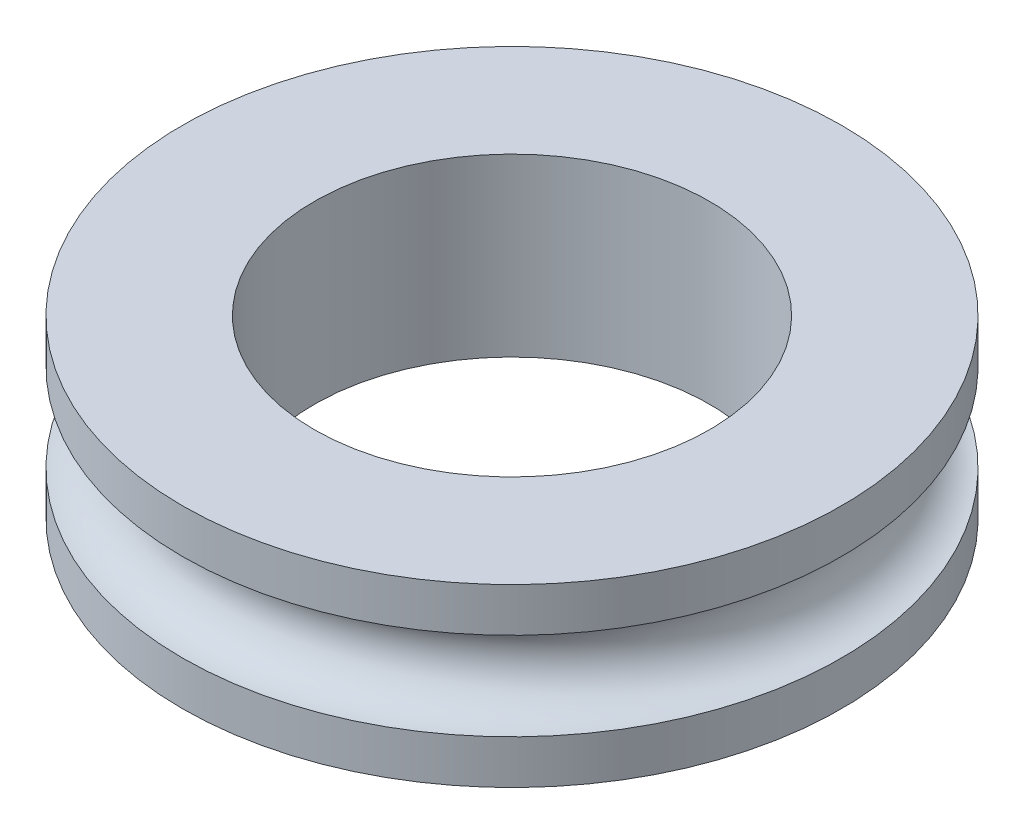
ISO-10303-21;
HEADER;
FILE_DESCRIPTION(('STEP AP214'),'2;1');
FILE_NAME('part.step','',(''),(''),'','','');
FILE_SCHEMA(('AUTOMOTIVE_DESIGN { 1 0 10303 214 1 1 1 1 }'));
ENDSEC;
DATA;
#1=APPLICATION_CONTEXT('core data for automotive mechanical design processes');
#2=APPLICATION_PROTOCOL_DEFINITION('international standard','automotive_design',2000,#1);
#3=PRODUCT_CONTEXT('',#1,'mechanical');
#4=PRODUCT('Part','Part','',(#3));
#5=PRODUCT_RELATED_PRODUCT_CATEGORY('part','',(#4));
#6=PRODUCT_DEFINITION_FORMATION('','',#4);
#7=PRODUCT_DEFINITION_CONTEXT('part definition',#1,'design');
#8=PRODUCT_DEFINITION('design','',#6,#7);
#9=PRODUCT_DEFINITION_SHAPE('','',#8);
#10=(LENGTH_UNIT() NAMED_UNIT(*) SI_UNIT(.MILLI.,.METRE.));
#11=(NAMED_UNIT(*) PLANE_ANGLE_UNIT() SI_UNIT($,.RADIAN.));
#12=(NAMED_UNIT(*) SI_UNIT($,.STERADIAN.) SOLID_ANGLE_UNIT());
#13=UNCERTAINTY_MEASURE_WITH_UNIT(LENGTH_MEASURE(1.E-05),#10,'distance_accuracy_value','');
#14=(GEOMETRIC_REPRESENTATION_CONTEXT(3) GLOBAL_UNCERTAINTY_ASSIGNED_CONTEXT((#13)) GLOBAL_UNIT_ASSIGNED_CONTEXT((#10,
#11,#12)) REPRESENTATION_CONTEXT('',''));
#15=CARTESIAN_POINT('',(0.,0.,0.));
#16=DIRECTION('',(0.,0.,1.));
#17=DIRECTION('',(1.,0.,0.));
#18=AXIS2_PLACEMENT_3D('',#15,#16,#17);
#19=CARTESIAN_POINT('',(0.,4.,0.));
#20=DIRECTION('',(0.,-1.,0.));
#21=DIRECTION('',(0.,0.,-1.));
#22=AXIS2_PLACEMENT_3D('',#19,#20,#21);
#23=CYLINDRICAL_SURFACE('',#22,7.5);
#24=CARTESIAN_POINT('',(0.,0.,0.));
#25=DIRECTION('',(0.,1.,0.));
#26=DIRECTION('',(0.,0.,1.));
#27=AXIS2_PLACEMENT_3D('',#24,#25,#26);
#28=CIRCLE('',#27,7.5);
#29=CARTESIAN_POINT('',(0.,0.,7.5));
#30=VERTEX_POINT('',#29);
#31=EDGE_CURVE('E37',#30,#30,#28,.T.);
#32=ORIENTED_EDGE('',*,*,#31,.T.);
#33=EDGE_LOOP('',(#32));
#34=FACE_BOUND('',#33,.T.);
#35=CARTESIAN_POINT('',(0.,1.,0.));
#36=DIRECTION('',(0.,-1.,0.));
#37=DIRECTION('',(0.,0.,-1.));
#38=AXIS2_PLACEMENT_3D('',#35,#36,#37);
#39=CIRCLE('',#38,7.5);
#40=CARTESIAN_POINT('',(0.,1.,-7.5));
#41=VERTEX_POINT('',#40);
#42=EDGE_CURVE('E49',#41,#41,#39,.T.);
#43=ORIENTED_EDGE('',*,*,#42,.T.);
#44=EDGE_LOOP('',(#43));
#45=FACE_BOUND('',#44,.T.);
#46=ADVANCED_FACE('F34',(#34,#45),#23,.T.);
#47=CARTESIAN_POINT('',(0.,4.,0.));
#48=DIRECTION('',(0.,1.,0.));
#49=DIRECTION('',(0.,0.,1.));
#50=AXIS2_PLACEMENT_3D('',#47,#48,#49);
#51=CIRCLE('',#50,7.5);
#52=CARTESIAN_POINT('',(0.,4.,7.5));
#53=VERTEX_POINT('',#52);
#54=EDGE_CURVE('E10',#53,#53,#51,.T.);
#55=ORIENTED_EDGE('',*,*,#54,.F.);
#56=EDGE_LOOP('',(#55));
#57=FACE_BOUND('',#56,.T.);
#58=CARTESIAN_POINT('',(0.,3.,0.));
#59=DIRECTION('',(0.,-1.,0.));
#60=DIRECTION('',(0.,0.,-1.));
#61=AXIS2_PLACEMENT_3D('',#58,#59,#60);
#62=CIRCLE('',#61,7.5);
#63=CARTESIAN_POINT('',(0.,3.,-7.5));
#64=VERTEX_POINT('',#63);
#65=EDGE_CURVE('E54',#64,#64,#62,.T.);
#66=ORIENTED_EDGE('',*,*,#65,.F.);
#67=EDGE_LOOP('',(#66));
#68=FACE_BOUND('',#67,.T.);
#69=ADVANCED_FACE('F61',(#57,#68),#23,.T.);
#70=CARTESIAN_POINT('',(0.,4.,0.));
#71=DIRECTION('',(0.,1.,0.));
#72=DIRECTION('',(0.,0.,1.));
#73=AXIS2_PLACEMENT_3D('',#70,#71,#72);
#74=PLANE('',#73);
#75=ORIENTED_EDGE('',*,*,#54,.T.);
#76=EDGE_LOOP('',(#75));
#77=FACE_BOUND('',#76,.T.);
#78=CARTESIAN_POINT('',(0.,4.,0.));
#79=DIRECTION('',(0.,1.,0.));
#80=DIRECTION('',(0.,0.,1.));
#81=AXIS2_PLACEMENT_3D('',#78,#79,#80);
#82=CIRCLE('',#81,4.5);
#83=CARTESIAN_POINT('',(0.,4.,4.5));
#84=VERTEX_POINT('',#83);
#85=EDGE_CURVE('E44',#84,#84,#82,.T.);
#86=ORIENTED_EDGE('',*,*,#85,.F.);
#87=EDGE_LOOP('',(#86));
#88=FACE_BOUND('',#87,.T.);
#89=ADVANCED_FACE('F63',(#77,#88),#74,.T.);
#90=CARTESIAN_POINT('',(0.,0.,0.));
#91=DIRECTION('',(0.,1.,0.));
#92=DIRECTION('',(0.,0.,1.));
#93=AXIS2_PLACEMENT_3D('',#90,#91,#92);
#94=PLANE('',#93);
#95=ORIENTED_EDGE('',*,*,#31,.F.);
#96=EDGE_LOOP('',(#95));
#97=FACE_BOUND('',#96,.T.);
#98=CARTESIAN_POINT('',(0.,0.,0.));
#99=DIRECTION('',(0.,1.,0.));
#100=DIRECTION('',(0.,0.,1.));
#101=AXIS2_PLACEMENT_3D('',#98,#99,#100);
#102=CIRCLE('',#101,4.5);
#103=CARTESIAN_POINT('',(0.,0.,4.5));
#104=VERTEX_POINT('',#103);
#105=EDGE_CURVE('E46',#104,#104,#102,.T.);
#106=ORIENTED_EDGE('',*,*,#105,.T.);
#107=EDGE_LOOP('',(#106));
#108=FACE_BOUND('',#107,.T.);
#109=ADVANCED_FACE('F69',(#97,#108),#94,.F.);
#110=CARTESIAN_POINT('',(0.,4.,0.));
#111=DIRECTION('',(0.,-1.,0.));
#112=DIRECTION('',(0.,0.,-1.));
#113=AXIS2_PLACEMENT_3D('',#110,#111,#112);
#114=CYLINDRICAL_SURFACE('',#113,4.5);
#115=ORIENTED_EDGE('',*,*,#85,.T.);
#116=EDGE_LOOP('',(#115));
#117=FACE_BOUND('',#116,.T.);
#118=ORIENTED_EDGE('',*,*,#105,.F.);
#119=EDGE_LOOP('',(#118));
#120=FACE_BOUND('',#119,.T.);
#121=ADVANCED_FACE('F78',(#117,#120),#114,.F.);
#122=CARTESIAN_POINT('',(0.,2.,0.));
#123=DIRECTION('',(0.,-1.,0.));
#124=DIRECTION('',(0.,0.,-1.));
#125=AXIS2_PLACEMENT_3D('',#122,#123,#124);
#126=TOROIDAL_SURFACE('',#125,7.5,1.);
#127=ORIENTED_EDGE('',*,*,#65,.T.);
#128=EDGE_LOOP('',(#127));
#129=FACE_BOUND('',#128,.T.);
#130=ORIENTED_EDGE('',*,*,#42,.F.);
#131=EDGE_LOOP('',(#130));
#132=FACE_BOUND('',#131,.T.);
#133=ADVANCED_FACE('F58',(#129,#132),#126,.F.);
#134=CLOSED_SHELL('',(#46,#69,#89,#109,#121,#133));
#135=MANIFOLD_SOLID_BREP('B2',#134);
#136=ADVANCED_BREP_SHAPE_REPRESENTATION('',(#18,#135),#14);
#137=SHAPE_DEFINITION_REPRESENTATION(#9,#136);
ENDSEC;
END-ISO-10303-21;
